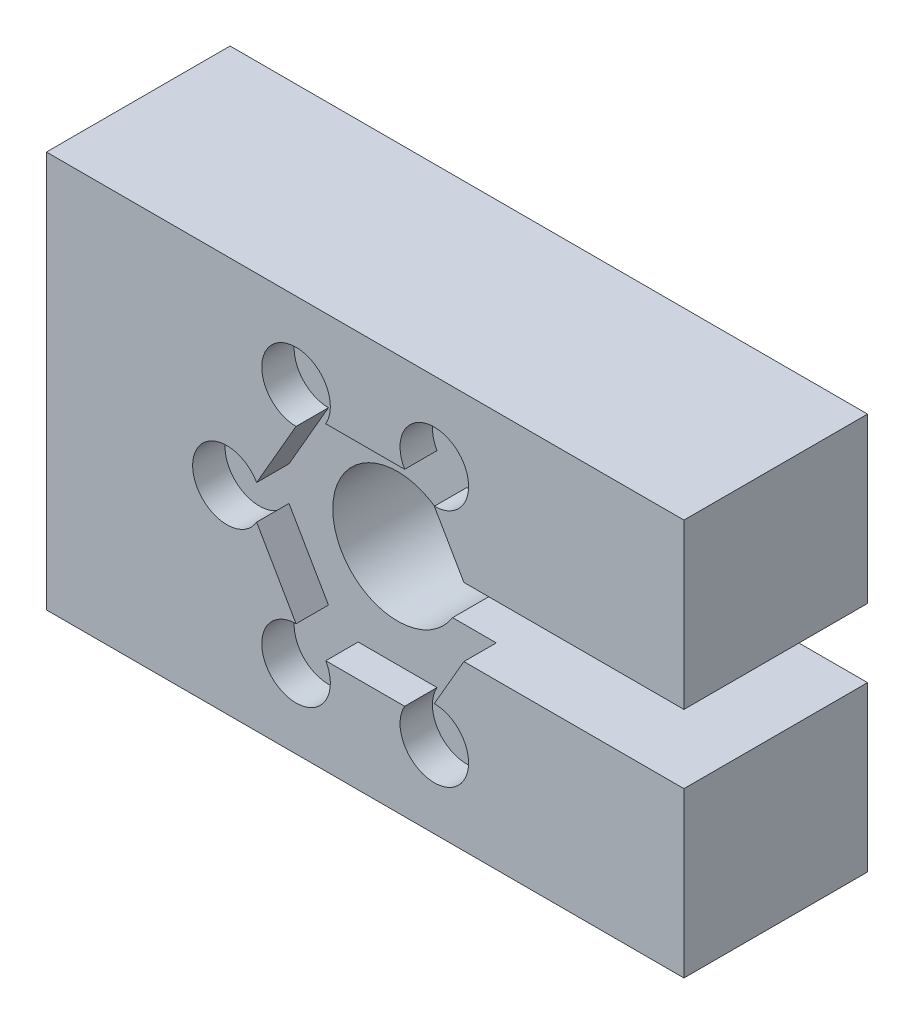
ISO-10303-21;
HEADER;
FILE_DESCRIPTION(('STEP AP214'),'2;1');
FILE_NAME('part.step','',(''),(''),'','','');
FILE_SCHEMA(('AUTOMOTIVE_DESIGN { 1 0 10303 214 1 1 1 1 }'));
ENDSEC;
DATA;
#1=APPLICATION_CONTEXT('core data for automotive mechanical design processes');
#2=APPLICATION_PROTOCOL_DEFINITION('international standard','automotive_design',2000,#1);
#3=PRODUCT_CONTEXT('',#1,'mechanical');
#4=PRODUCT('Part','Part','',(#3));
#5=PRODUCT_RELATED_PRODUCT_CATEGORY('part','',(#4));
#6=PRODUCT_DEFINITION_FORMATION('','',#4);
#7=PRODUCT_DEFINITION_CONTEXT('part definition',#1,'design');
#8=PRODUCT_DEFINITION('design','',#6,#7);
#9=PRODUCT_DEFINITION_SHAPE('','',#8);
#10=(LENGTH_UNIT() NAMED_UNIT(*) SI_UNIT(.MILLI.,.METRE.));
#11=(NAMED_UNIT(*) PLANE_ANGLE_UNIT() SI_UNIT($,.RADIAN.));
#12=(NAMED_UNIT(*) SI_UNIT($,.STERADIAN.) SOLID_ANGLE_UNIT());
#13=UNCERTAINTY_MEASURE_WITH_UNIT(LENGTH_MEASURE(1.E-05),#10,'distance_accuracy_value','');
#14=(GEOMETRIC_REPRESENTATION_CONTEXT(3) GLOBAL_UNCERTAINTY_ASSIGNED_CONTEXT((#13)) GLOBAL_UNIT_ASSIGNED_CONTEXT((#10,
#11,#12)) REPRESENTATION_CONTEXT('',''));
#15=CARTESIAN_POINT('',(0.,0.,0.));
#16=DIRECTION('',(0.,0.,1.));
#17=DIRECTION('',(1.,0.,0.));
#18=AXIS2_PLACEMENT_3D('',#15,#16,#17);
#19=CARTESIAN_POINT('',(14.755382296394,1.5875,1.5));
#20=DIRECTION('',(-1.,0.,0.));
#21=DIRECTION('',(0.,0.,1.));
#22=AXIS2_PLACEMENT_3D('',#19,#20,#21);
#23=PLANE('',#22);
#24=DIRECTION('',(0.,0.,-1.));
#25=VECTOR('',#24,1.);
#26=CARTESIAN_POINT('',(14.755382296394,1.5875,1.5));
#27=LINE('',#26,#25);
#28=CARTESIAN_POINT('',(14.755382296394,1.5875,1.5));
#29=VERTEX_POINT('',#28);
#30=CARTESIAN_POINT('',(14.755382296394,1.5875,-7.));
#31=VERTEX_POINT('',#30);
#32=EDGE_CURVE('E204',#29,#31,#27,.T.);
#33=ORIENTED_EDGE('',*,*,#32,.T.);
#34=DIRECTION('',(0.,-1.,0.));
#35=VECTOR('',#34,1.);
#36=CARTESIAN_POINT('',(14.755382296394,9.17903824382895,-7.));
#37=LINE('',#36,#35);
#38=CARTESIAN_POINT('',(14.755382296394,9.17903824382895,-7.));
#39=VERTEX_POINT('',#38);
#40=EDGE_CURVE('E259',#39,#31,#37,.T.);
#41=ORIENTED_EDGE('',*,*,#40,.F.);
#42=DIRECTION('',(0.,0.,-1.));
#43=VECTOR('',#42,1.);
#44=CARTESIAN_POINT('',(14.755382296394,9.17903824382895,1.5));
#45=LINE('',#44,#43);
#46=CARTESIAN_POINT('',(14.755382296394,9.17903824382895,1.5));
#47=VERTEX_POINT('',#46);
#48=EDGE_CURVE('E11',#47,#39,#45,.T.);
#49=ORIENTED_EDGE('',*,*,#48,.F.);
#50=DIRECTION('',(0.,1.,0.));
#51=VECTOR('',#50,1.);
#52=CARTESIAN_POINT('',(14.755382296394,1.5875,1.5));
#53=LINE('',#52,#51);
#54=EDGE_CURVE('E221',#29,#47,#53,.T.);
#55=ORIENTED_EDGE('',*,*,#54,.F.);
#56=EDGE_LOOP('',(#33,#41,#49,#55));
#57=FACE_BOUND('',#56,.T.);
#58=ADVANCED_FACE('F39',(#57),#23,.F.);
#59=CARTESIAN_POINT('',(-14.755382296394,9.17903824382895,1.5));
#60=DIRECTION('',(0.,-1.,0.));
#61=DIRECTION('',(0.,0.,-1.));
#62=AXIS2_PLACEMENT_3D('',#59,#60,#61);
#63=PLANE('',#62);
#64=ORIENTED_EDGE('',*,*,#48,.T.);
#65=DIRECTION('',(1.,0.,0.));
#66=VECTOR('',#65,1.);
#67=CARTESIAN_POINT('',(-14.755382296394,9.17903824382895,-7.));
#68=LINE('',#67,#66);
#69=CARTESIAN_POINT('',(-14.755382296394,9.17903824382895,-7.));
#70=VERTEX_POINT('',#69);
#71=EDGE_CURVE('E250',#70,#39,#68,.T.);
#72=ORIENTED_EDGE('',*,*,#71,.F.);
#73=DIRECTION('',(0.,0.,-1.));
#74=VECTOR('',#73,1.);
#75=CARTESIAN_POINT('',(-14.755382296394,9.17903824382895,1.5));
#76=LINE('',#75,#74);
#77=CARTESIAN_POINT('',(-14.755382296394,9.17903824382895,1.5));
#78=VERTEX_POINT('',#77);
#79=EDGE_CURVE('E46',#78,#70,#76,.T.);
#80=ORIENTED_EDGE('',*,*,#79,.F.);
#81=DIRECTION('',(-1.,0.,0.));
#82=VECTOR('',#81,1.);
#83=CARTESIAN_POINT('',(-14.755382296394,9.17903824382895,1.5));
#84=LINE('',#83,#82);
#85=EDGE_CURVE('E290',#47,#78,#84,.T.);
#86=ORIENTED_EDGE('',*,*,#85,.F.);
#87=EDGE_LOOP('',(#64,#72,#80,#86));
#88=FACE_BOUND('',#87,.T.);
#89=ADVANCED_FACE('F256',(#88),#63,.F.);
#90=CARTESIAN_POINT('',(-14.755382296394,-9.17903824382895,1.5));
#91=DIRECTION('',(1.,0.,0.));
#92=DIRECTION('',(0.,0.,-1.));
#93=AXIS2_PLACEMENT_3D('',#90,#91,#92);
#94=PLANE('',#93);
#95=ORIENTED_EDGE('',*,*,#79,.T.);
#96=DIRECTION('',(0.,1.,0.));
#97=VECTOR('',#96,1.);
#98=CARTESIAN_POINT('',(-14.755382296394,-9.17903824382895,-7.));
#99=LINE('',#98,#97);
#100=CARTESIAN_POINT('',(-14.755382296394,-9.17903824382895,-7.));
#101=VERTEX_POINT('',#100);
#102=EDGE_CURVE('E241',#101,#70,#99,.T.);
#103=ORIENTED_EDGE('',*,*,#102,.F.);
#104=DIRECTION('',(0.,0.,-1.));
#105=VECTOR('',#104,1.);
#106=CARTESIAN_POINT('',(-14.755382296394,-9.17903824382895,1.5));
#107=LINE('',#106,#105);
#108=CARTESIAN_POINT('',(-14.755382296394,-9.17903824382895,1.5));
#109=VERTEX_POINT('',#108);
#110=EDGE_CURVE('E233',#109,#101,#107,.T.);
#111=ORIENTED_EDGE('',*,*,#110,.F.);
#112=DIRECTION('',(0.,-1.,0.));
#113=VECTOR('',#112,1.);
#114=CARTESIAN_POINT('',(-14.755382296394,-9.17903824382895,1.5));
#115=LINE('',#114,#113);
#116=EDGE_CURVE('E242',#78,#109,#115,.T.);
#117=ORIENTED_EDGE('',*,*,#116,.F.);
#118=EDGE_LOOP('',(#95,#103,#111,#117));
#119=FACE_BOUND('',#118,.T.);
#120=ADVANCED_FACE('F239',(#119),#94,.F.);
#121=CARTESIAN_POINT('',(-14.755382296394,-9.17903824382895,1.5));
#122=DIRECTION('',(0.,1.,0.));
#123=DIRECTION('',(0.,0.,1.));
#124=AXIS2_PLACEMENT_3D('',#121,#122,#123);
#125=PLANE('',#124);
#126=ORIENTED_EDGE('',*,*,#110,.T.);
#127=DIRECTION('',(-1.,0.,0.));
#128=VECTOR('',#127,1.);
#129=CARTESIAN_POINT('',(14.755382296394,-9.17903824382895,-7.));
#130=LINE('',#129,#128);
#131=CARTESIAN_POINT('',(14.755382296394,-9.17903824382895,-7.));
#132=VERTEX_POINT('',#131);
#133=EDGE_CURVE('E253',#132,#101,#130,.T.);
#134=ORIENTED_EDGE('',*,*,#133,.F.);
#135=DIRECTION('',(0.,0.,-1.));
#136=VECTOR('',#135,1.);
#137=CARTESIAN_POINT('',(14.755382296394,-9.17903824382895,1.5));
#138=LINE('',#137,#136);
#139=CARTESIAN_POINT('',(14.755382296394,-9.17903824382895,1.5));
#140=VERTEX_POINT('',#139);
#141=EDGE_CURVE('E231',#140,#132,#138,.T.);
#142=ORIENTED_EDGE('',*,*,#141,.F.);
#143=DIRECTION('',(1.,0.,0.));
#144=VECTOR('',#143,1.);
#145=CARTESIAN_POINT('',(-14.755382296394,-9.17903824382895,1.5));
#146=LINE('',#145,#144);
#147=EDGE_CURVE('E293',#109,#140,#146,.T.);
#148=ORIENTED_EDGE('',*,*,#147,.F.);
#149=EDGE_LOOP('',(#126,#134,#142,#148));
#150=FACE_BOUND('',#149,.T.);
#151=ADVANCED_FACE('F388',(#150),#125,.F.);
#152=CARTESIAN_POINT('',(14.755382296394,-9.17903824382895,1.5));
#153=DIRECTION('',(-1.,0.,0.));
#154=DIRECTION('',(0.,0.,1.));
#155=AXIS2_PLACEMENT_3D('',#152,#153,#154);
#156=PLANE('',#155);
#157=ORIENTED_EDGE('',*,*,#141,.T.);
#158=DIRECTION('',(0.,-1.,0.));
#159=VECTOR('',#158,1.);
#160=CARTESIAN_POINT('',(14.755382296394,-1.5875,-7.));
#161=LINE('',#160,#159);
#162=CARTESIAN_POINT('',(14.755382296394,-1.5875,-7.));
#163=VERTEX_POINT('',#162);
#164=EDGE_CURVE('E277',#163,#132,#161,.T.);
#165=ORIENTED_EDGE('',*,*,#164,.F.);
#166=DIRECTION('',(0.,0.,-1.));
#167=VECTOR('',#166,1.);
#168=CARTESIAN_POINT('',(14.755382296394,-1.5875,1.5));
#169=LINE('',#168,#167);
#170=CARTESIAN_POINT('',(14.755382296394,-1.5875,1.5));
#171=VERTEX_POINT('',#170);
#172=EDGE_CURVE('E229',#171,#163,#169,.T.);
#173=ORIENTED_EDGE('',*,*,#172,.F.);
#174=DIRECTION('',(0.,1.,0.));
#175=VECTOR('',#174,1.);
#176=CARTESIAN_POINT('',(14.755382296394,-9.17903824382895,1.5));
#177=LINE('',#176,#175);
#178=EDGE_CURVE('E295',#140,#171,#177,.T.);
#179=ORIENTED_EDGE('',*,*,#178,.F.);
#180=EDGE_LOOP('',(#157,#165,#173,#179));
#181=FACE_BOUND('',#180,.T.);
#182=ADVANCED_FACE('F383',(#181),#156,.F.);
#183=CARTESIAN_POINT('',(14.755382296394,-1.5875,1.5));
#184=DIRECTION('',(0.,-1.,0.));
#185=DIRECTION('',(1.,0.,0.));
#186=AXIS2_PLACEMENT_3D('',#183,#184,#185);
#187=PLANE('',#186);
#188=DIRECTION('',(0.,0.,-1.));
#189=VECTOR('',#188,1.);
#190=CARTESIAN_POINT('',(4.56828400496291,-1.5875,1.5));
#191=LINE('',#190,#189);
#192=CARTESIAN_POINT('',(4.56828400496291,-1.5875,1.5));
#193=VERTEX_POINT('',#192);
#194=CARTESIAN_POINT('',(4.56828400496291,-1.5875,0.));
#195=VERTEX_POINT('',#194);
#196=EDGE_CURVE('E226',#193,#195,#191,.T.);
#197=ORIENTED_EDGE('',*,*,#196,.F.);
#198=DIRECTION('',(-1.,0.,0.));
#199=VECTOR('',#198,1.);
#200=CARTESIAN_POINT('',(14.755382296394,-1.5875,1.5));
#201=LINE('',#200,#199);
#202=EDGE_CURVE('E297',#171,#193,#201,.T.);
#203=ORIENTED_EDGE('',*,*,#202,.F.);
#204=ORIENTED_EDGE('',*,*,#172,.T.);
#205=DIRECTION('',(1.,0.,0.));
#206=VECTOR('',#205,1.);
#207=CARTESIAN_POINT('',(4.56828400496291,-1.5875,-7.));
#208=LINE('',#207,#206);
#209=CARTESIAN_POINT('',(2.54555372168807,-1.5875,-7.));
#210=VERTEX_POINT('',#209);
#211=EDGE_CURVE('E274',#210,#163,#208,.T.);
#212=ORIENTED_EDGE('',*,*,#211,.F.);
#213=DIRECTION('',(0.,0.,1.));
#214=VECTOR('',#213,1.);
#215=CARTESIAN_POINT('',(2.54555372168807,-1.5875,-7.));
#216=LINE('',#215,#214);
#217=CARTESIAN_POINT('',(2.54555372168807,-1.5875,0.));
#218=VERTEX_POINT('',#217);
#219=EDGE_CURVE('E254',#210,#218,#216,.T.);
#220=ORIENTED_EDGE('',*,*,#219,.T.);
#221=DIRECTION('',(1.,0.,0.));
#222=VECTOR('',#221,1.);
#223=CARTESIAN_POINT('',(4.56828400496291,-1.5875,0.));
#224=LINE('',#223,#222);
#225=EDGE_CURVE('E260',#218,#195,#224,.T.);
#226=ORIENTED_EDGE('',*,*,#225,.T.);
#227=EDGE_LOOP('',(#197,#203,#204,#212,#220,#226));
#228=FACE_BOUND('',#227,.T.);
#229=ADVANCED_FACE('F360',(#228),#187,.F.);
#230=CARTESIAN_POINT('',(2.74241377865072,-4.75,1.5));
#231=DIRECTION('',(0.866025403784439,-0.499999999999999,0.));
#232=DIRECTION('',(0.499999999999999,0.866025403784439,0.));
#233=AXIS2_PLACEMENT_3D('',#230,#231,#232);
#234=PLANE('',#233);
#235=DIRECTION('',(-0.499999999999999,-0.866025403784439,0.));
#236=VECTOR('',#235,1.);
#237=CARTESIAN_POINT('',(2.74241377865072,-4.75,0.));
#238=LINE('',#237,#236);
#239=CARTESIAN_POINT('',(3.20068555481998,-3.95625000000002,0.));
#240=VERTEX_POINT('',#239);
#241=EDGE_CURVE('E205',#195,#240,#238,.T.);
#242=ORIENTED_EDGE('',*,*,#241,.T.);
#243=DIRECTION('',(0.,0.,1.));
#244=VECTOR('',#243,1.);
#245=CARTESIAN_POINT('',(3.20068555481998,-3.95625000000002,-4.49012806053458));
#246=LINE('',#245,#244);
#247=CARTESIAN_POINT('',(3.20068555481998,-3.95625000000002,1.5));
#248=VERTEX_POINT('',#247);
#249=EDGE_CURVE('E329',#240,#248,#246,.T.);
#250=ORIENTED_EDGE('',*,*,#249,.T.);
#251=DIRECTION('',(-0.499999999999999,-0.866025403784439,0.));
#252=VECTOR('',#251,1.);
#253=CARTESIAN_POINT('',(2.74241377865072,-4.75,1.5));
#254=LINE('',#253,#252);
#255=EDGE_CURVE('E299',#193,#248,#254,.T.);
#256=ORIENTED_EDGE('',*,*,#255,.F.);
#257=ORIENTED_EDGE('',*,*,#196,.T.);
#258=EDGE_LOOP('',(#242,#250,#256,#257));
#259=FACE_BOUND('',#258,.T.);
#260=ADVANCED_FACE('F355',(#259),#234,.F.);
#261=CARTESIAN_POINT('',(-2.74241377865072,-4.75,1.5));
#262=DIRECTION('',(0.,-1.,0.));
#263=DIRECTION('',(1.,0.,0.));
#264=AXIS2_PLACEMENT_3D('',#261,#262,#263);
#265=PLANE('',#264);
#266=DIRECTION('',(-1.,0.,0.));
#267=VECTOR('',#266,1.);
#268=CARTESIAN_POINT('',(-2.74241377865072,-4.75,0.));
#269=LINE('',#268,#267);
#270=CARTESIAN_POINT('',(1.82587022631217,-4.75,0.));
#271=VERTEX_POINT('',#270);
#272=CARTESIAN_POINT('',(-1.82587022631222,-4.75,0.));
#273=VERTEX_POINT('',#272);
#274=EDGE_CURVE('E208',#271,#273,#269,.T.);
#275=ORIENTED_EDGE('',*,*,#274,.T.);
#276=DIRECTION('',(0.,0.,1.));
#277=VECTOR('',#276,1.);
#278=CARTESIAN_POINT('',(-1.82587022631222,-4.75,-4.49012806053458));
#279=LINE('',#278,#277);
#280=CARTESIAN_POINT('',(-1.82587022631222,-4.75,1.5));
#281=VERTEX_POINT('',#280);
#282=EDGE_CURVE('E323',#273,#281,#279,.T.);
#283=ORIENTED_EDGE('',*,*,#282,.T.);
#284=DIRECTION('',(-1.,0.,0.));
#285=VECTOR('',#284,1.);
#286=CARTESIAN_POINT('',(-2.74241377865072,-4.75,1.5));
#287=LINE('',#286,#285);
#288=CARTESIAN_POINT('',(1.82587022631217,-4.75,1.5));
#289=VERTEX_POINT('',#288);
#290=EDGE_CURVE('E302',#289,#281,#287,.T.);
#291=ORIENTED_EDGE('',*,*,#290,.F.);
#292=DIRECTION('',(0.,0.,1.));
#293=VECTOR('',#292,1.);
#294=CARTESIAN_POINT('',(1.82587022631217,-4.75,-4.49012806053458));
#295=LINE('',#294,#293);
#296=EDGE_CURVE('E189',#289,#271,#295,.F.);
#297=ORIENTED_EDGE('',*,*,#296,.T.);
#298=EDGE_LOOP('',(#275,#283,#291,#297));
#299=FACE_BOUND('',#298,.T.);
#300=ADVANCED_FACE('F392',(#299),#265,.F.);
#301=CARTESIAN_POINT('',(-5.48482755730144,0.,1.5));
#302=DIRECTION('',(-0.866025403784438,-0.5,0.));
#303=DIRECTION('',(0.5,-0.866025403784439,0.));
#304=AXIS2_PLACEMENT_3D('',#301,#302,#303);
#305=PLANE('',#304);
#306=DIRECTION('',(-0.5,0.866025403784438,0.));
#307=VECTOR('',#306,1.);
#308=CARTESIAN_POINT('',(-5.48482755730144,0.,0.));
#309=LINE('',#308,#307);
#310=CARTESIAN_POINT('',(-3.20068555482,-3.95624999999998,0.));
#311=VERTEX_POINT('',#310);
#312=CARTESIAN_POINT('',(-5.0265557811322,-0.793749999999971,0.));
#313=VERTEX_POINT('',#312);
#314=EDGE_CURVE('E212',#311,#313,#309,.T.);
#315=ORIENTED_EDGE('',*,*,#314,.T.);
#316=DIRECTION('',(0.,0.,1.));
#317=VECTOR('',#316,1.);
#318=CARTESIAN_POINT('',(-5.0265557811322,-0.79374999999997,-4.49012806053458));
#319=LINE('',#318,#317);
#320=CARTESIAN_POINT('',(-5.0265557811322,-0.793749999999971,1.5));
#321=VERTEX_POINT('',#320);
#322=EDGE_CURVE('E317',#313,#321,#319,.T.);
#323=ORIENTED_EDGE('',*,*,#322,.T.);
#324=DIRECTION('',(-0.5,0.866025403784438,0.));
#325=VECTOR('',#324,1.);
#326=CARTESIAN_POINT('',(-5.48482755730144,0.,1.5));
#327=LINE('',#326,#325);
#328=CARTESIAN_POINT('',(-3.20068555482,-3.95624999999998,1.5));
#329=VERTEX_POINT('',#328);
#330=EDGE_CURVE('E199',#329,#321,#327,.T.);
#331=ORIENTED_EDGE('',*,*,#330,.F.);
#332=DIRECTION('',(0.,0.,1.));
#333=VECTOR('',#332,1.);
#334=CARTESIAN_POINT('',(-3.20068555482,-3.95624999999998,-4.49012806053458));
#335=LINE('',#334,#333);
#336=EDGE_CURVE('E315',#329,#311,#335,.F.);
#337=ORIENTED_EDGE('',*,*,#336,.T.);
#338=EDGE_LOOP('',(#315,#323,#331,#337));
#339=FACE_BOUND('',#338,.T.);
#340=ADVANCED_FACE('F314',(#339),#305,.F.);
#341=CARTESIAN_POINT('',(-2.74241377865072,4.75,1.5));
#342=DIRECTION('',(-0.866025403784439,0.5,0.));
#343=DIRECTION('',(-0.5,-0.866025403784439,0.));
#344=AXIS2_PLACEMENT_3D('',#341,#342,#343);
#345=PLANE('',#344);
#346=DIRECTION('',(0.5,0.866025403784439,0.));
#347=VECTOR('',#346,1.);
#348=CARTESIAN_POINT('',(-2.74241377865072,4.75,0.));
#349=LINE('',#348,#347);
#350=CARTESIAN_POINT('',(-5.02655578113216,0.793750000000027,0.));
#351=VERTEX_POINT('',#350);
#352=CARTESIAN_POINT('',(-3.20068555481997,3.95625000000004,0.));
#353=VERTEX_POINT('',#352);
#354=EDGE_CURVE('E215',#351,#353,#349,.T.);
#355=ORIENTED_EDGE('',*,*,#354,.T.);
#356=DIRECTION('',(0.,0.,1.));
#357=VECTOR('',#356,1.);
#358=CARTESIAN_POINT('',(-3.20068555481997,3.95625000000004,-4.49012806053458));
#359=LINE('',#358,#357);
#360=CARTESIAN_POINT('',(-3.20068555481997,3.95625000000004,1.5));
#361=VERTEX_POINT('',#360);
#362=EDGE_CURVE('E268',#353,#361,#359,.T.);
#363=ORIENTED_EDGE('',*,*,#362,.T.);
#364=DIRECTION('',(0.5,0.866025403784439,0.));
#365=VECTOR('',#364,1.);
#366=CARTESIAN_POINT('',(-2.74241377865072,4.75,1.5));
#367=LINE('',#366,#365);
#368=CARTESIAN_POINT('',(-5.02655578113216,0.793750000000027,1.5));
#369=VERTEX_POINT('',#368);
#370=EDGE_CURVE('E195',#369,#361,#367,.T.);
#371=ORIENTED_EDGE('',*,*,#370,.F.);
#372=DIRECTION('',(0.,0.,1.));
#373=VECTOR('',#372,1.);
#374=CARTESIAN_POINT('',(-5.02655578113216,0.793750000000027,-4.49012806053458));
#375=LINE('',#374,#373);
#376=EDGE_CURVE('E320',#369,#351,#375,.F.);
#377=ORIENTED_EDGE('',*,*,#376,.T.);
#378=EDGE_LOOP('',(#355,#363,#371,#377));
#379=FACE_BOUND('',#378,.T.);
#380=ADVANCED_FACE('F398',(#379),#345,.F.);
#381=CARTESIAN_POINT('',(2.74241377865072,4.75,1.5));
#382=DIRECTION('',(0.,1.,0.));
#383=DIRECTION('',(0.,0.,1.));
#384=AXIS2_PLACEMENT_3D('',#381,#382,#383);
#385=PLANE('',#384);
#386=DIRECTION('',(1.,0.,0.));
#387=VECTOR('',#386,1.);
#388=CARTESIAN_POINT('',(2.74241377865072,4.75,1.5));
#389=LINE('',#388,#387);
#390=CARTESIAN_POINT('',(-1.82587022631215,4.75,1.5));
#391=VERTEX_POINT('',#390);
#392=CARTESIAN_POINT('',(1.82587022631219,4.75,1.5));
#393=VERTEX_POINT('',#392);
#394=EDGE_CURVE('E186',#391,#393,#389,.T.);
#395=ORIENTED_EDGE('',*,*,#394,.F.);
#396=DIRECTION('',(0.,0.,1.));
#397=VECTOR('',#396,1.);
#398=CARTESIAN_POINT('',(-1.82587022631215,4.75,-4.49012806053458));
#399=LINE('',#398,#397);
#400=CARTESIAN_POINT('',(-1.82587022631215,4.75,0.));
#401=VERTEX_POINT('',#400);
#402=EDGE_CURVE('E61',#391,#401,#399,.F.);
#403=ORIENTED_EDGE('',*,*,#402,.T.);
#404=DIRECTION('',(1.,0.,0.));
#405=VECTOR('',#404,1.);
#406=CARTESIAN_POINT('',(2.74241377865072,4.75,0.));
#407=LINE('',#406,#405);
#408=CARTESIAN_POINT('',(1.82587022631219,4.75,0.));
#409=VERTEX_POINT('',#408);
#410=EDGE_CURVE('E188',#401,#409,#407,.T.);
#411=ORIENTED_EDGE('',*,*,#410,.T.);
#412=DIRECTION('',(0.,0.,1.));
#413=VECTOR('',#412,1.);
#414=CARTESIAN_POINT('',(1.82587022631219,4.75,-4.49012806053458));
#415=LINE('',#414,#413);
#416=EDGE_CURVE('E174',#409,#393,#415,.T.);
#417=ORIENTED_EDGE('',*,*,#416,.T.);
#418=EDGE_LOOP('',(#395,#403,#411,#417));
#419=FACE_BOUND('',#418,.T.);
#420=ADVANCED_FACE('F185',(#419),#385,.F.);
#421=CARTESIAN_POINT('',(4.56828400496292,1.5875,1.5));
#422=DIRECTION('',(0.866025403784438,0.500000000000001,0.));
#423=DIRECTION('',(-0.500000000000001,0.866025403784438,0.));
#424=AXIS2_PLACEMENT_3D('',#421,#422,#423);
#425=PLANE('',#424);
#426=DIRECTION('',(0.500000000000001,-0.866025403784438,0.));
#427=VECTOR('',#426,1.);
#428=CARTESIAN_POINT('',(4.56828400496292,1.5875,1.5));
#429=LINE('',#428,#427);
#430=CARTESIAN_POINT('',(3.20068555481999,3.95625,1.5));
#431=VERTEX_POINT('',#430);
#432=CARTESIAN_POINT('',(4.56828400496292,1.5875,1.5));
#433=VERTEX_POINT('',#432);
#434=EDGE_CURVE('E194',#431,#433,#429,.T.);
#435=ORIENTED_EDGE('',*,*,#434,.F.);
#436=DIRECTION('',(0.,0.,1.));
#437=VECTOR('',#436,1.);
#438=CARTESIAN_POINT('',(3.20068555481999,3.95625,-4.49012806053458));
#439=LINE('',#438,#437);
#440=CARTESIAN_POINT('',(3.20068555481999,3.95625,0.));
#441=VERTEX_POINT('',#440);
#442=EDGE_CURVE('E53',#431,#441,#439,.F.);
#443=ORIENTED_EDGE('',*,*,#442,.T.);
#444=DIRECTION('',(0.500000000000001,-0.866025403784438,0.));
#445=VECTOR('',#444,1.);
#446=CARTESIAN_POINT('',(4.56828400496292,1.5875,0.));
#447=LINE('',#446,#445);
#448=CARTESIAN_POINT('',(4.56828400496292,1.5875,0.));
#449=VERTEX_POINT('',#448);
#450=EDGE_CURVE('E219',#441,#449,#447,.T.);
#451=ORIENTED_EDGE('',*,*,#450,.T.);
#452=DIRECTION('',(0.,0.,-1.));
#453=VECTOR('',#452,1.);
#454=CARTESIAN_POINT('',(4.56828400496292,1.5875,1.5));
#455=LINE('',#454,#453);
#456=EDGE_CURVE('E223',#433,#449,#455,.T.);
#457=ORIENTED_EDGE('',*,*,#456,.F.);
#458=EDGE_LOOP('',(#435,#443,#451,#457));
#459=FACE_BOUND('',#458,.T.);
#460=ADVANCED_FACE('F377',(#459),#425,.F.);
#461=CARTESIAN_POINT('',(14.755382296394,1.5875,1.5));
#462=DIRECTION('',(0.,1.,0.));
#463=DIRECTION('',(-1.,0.,0.));
#464=AXIS2_PLACEMENT_3D('',#461,#462,#463);
#465=PLANE('',#464);
#466=ORIENTED_EDGE('',*,*,#32,.F.);
#467=DIRECTION('',(1.,0.,0.));
#468=VECTOR('',#467,1.);
#469=CARTESIAN_POINT('',(14.755382296394,1.5875,1.5));
#470=LINE('',#469,#468);
#471=EDGE_CURVE('E197',#433,#29,#470,.T.);
#472=ORIENTED_EDGE('',*,*,#471,.F.);
#473=ORIENTED_EDGE('',*,*,#456,.T.);
#474=DIRECTION('',(-1.,0.,0.));
#475=VECTOR('',#474,1.);
#476=CARTESIAN_POINT('',(4.56828400496292,1.5875,0.));
#477=LINE('',#476,#475);
#478=CARTESIAN_POINT('',(2.54555372168807,1.5875,0.));
#479=VERTEX_POINT('',#478);
#480=EDGE_CURVE('E280',#449,#479,#477,.T.);
#481=ORIENTED_EDGE('',*,*,#480,.T.);
#482=DIRECTION('',(0.,0.,1.));
#483=VECTOR('',#482,1.);
#484=CARTESIAN_POINT('',(2.54555372168807,1.5875,-7.));
#485=LINE('',#484,#483);
#486=CARTESIAN_POINT('',(2.54555372168807,1.5875,-7.));
#487=VERTEX_POINT('',#486);
#488=EDGE_CURVE('E209',#487,#479,#485,.T.);
#489=ORIENTED_EDGE('',*,*,#488,.F.);
#490=DIRECTION('',(-1.,0.,0.));
#491=VECTOR('',#490,1.);
#492=CARTESIAN_POINT('',(14.755382296394,1.5875,-7.));
#493=LINE('',#492,#491);
#494=EDGE_CURVE('E262',#31,#487,#493,.T.);
#495=ORIENTED_EDGE('',*,*,#494,.F.);
#496=EDGE_LOOP('',(#466,#472,#473,#481,#489,#495));
#497=FACE_BOUND('',#496,.T.);
#498=ADVANCED_FACE('F372',(#497),#465,.F.);
#499=CARTESIAN_POINT('',(0.,0.,1.5));
#500=DIRECTION('',(0.,0.,-1.));
#501=DIRECTION('',(-1.,0.,0.));
#502=AXIS2_PLACEMENT_3D('',#499,#500,#501);
#503=PLANE('',#502);
#504=ORIENTED_EDGE('',*,*,#370,.T.);
#505=CARTESIAN_POINT('',(-3.20068555481992,5.54375000000004,1.5));
#506=DIRECTION('',(0.,0.,1.));
#507=DIRECTION('',(1.,0.,0.));
#508=AXIS2_PLACEMENT_3D('',#505,#506,#507);
#509=CIRCLE('',#508,1.5875);
#510=EDGE_CURVE('E193',#391,#361,#509,.T.);
#511=ORIENTED_EDGE('',*,*,#510,.F.);
#512=ORIENTED_EDGE('',*,*,#394,.T.);
#513=CARTESIAN_POINT('',(3.20068555481999,5.54375,1.5));
#514=DIRECTION('',(0.,0.,1.));
#515=DIRECTION('',(1.,0.,0.));
#516=AXIS2_PLACEMENT_3D('',#513,#514,#515);
#517=CIRCLE('',#516,1.5875);
#518=EDGE_CURVE('E171',#431,#393,#517,.T.);
#519=ORIENTED_EDGE('',*,*,#518,.F.);
#520=ORIENTED_EDGE('',*,*,#434,.T.);
#521=ORIENTED_EDGE('',*,*,#471,.T.);
#522=ORIENTED_EDGE('',*,*,#54,.T.);
#523=ORIENTED_EDGE('',*,*,#85,.T.);
#524=ORIENTED_EDGE('',*,*,#116,.T.);
#525=ORIENTED_EDGE('',*,*,#147,.T.);
#526=ORIENTED_EDGE('',*,*,#178,.T.);
#527=ORIENTED_EDGE('',*,*,#202,.T.);
#528=ORIENTED_EDGE('',*,*,#255,.T.);
#529=CARTESIAN_POINT('',(3.20068555481996,-5.54375000000002,1.5));
#530=DIRECTION('',(0.,0.,1.));
#531=DIRECTION('',(1.,0.,0.));
#532=AXIS2_PLACEMENT_3D('',#529,#530,#531);
#533=CIRCLE('',#532,1.5875);
#534=EDGE_CURVE('E180',#289,#248,#533,.T.);
#535=ORIENTED_EDGE('',*,*,#534,.F.);
#536=ORIENTED_EDGE('',*,*,#290,.T.);
#537=CARTESIAN_POINT('',(-3.20068555482003,-5.54374999999998,1.5));
#538=DIRECTION('',(0.,0.,1.));
#539=DIRECTION('',(1.,0.,0.));
#540=AXIS2_PLACEMENT_3D('',#537,#538,#539);
#541=CIRCLE('',#540,1.5875);
#542=EDGE_CURVE('E310',#329,#281,#541,.T.);
#543=ORIENTED_EDGE('',*,*,#542,.F.);
#544=ORIENTED_EDGE('',*,*,#330,.T.);
#545=CARTESIAN_POINT('',(-6.40137110963998,0.,1.5));
#546=DIRECTION('',(0.,0.,1.));
#547=DIRECTION('',(1.,0.,0.));
#548=AXIS2_PLACEMENT_3D('',#545,#546,#547);
#549=CIRCLE('',#548,1.5875);
#550=EDGE_CURVE('E308',#369,#321,#549,.T.);
#551=ORIENTED_EDGE('',*,*,#550,.F.);
#552=EDGE_LOOP('',(#504,#511,#512,#519,#520,#521,#522,#523,#524,#525,#526,#527,#528,#535,#536,
#543,#544,#551));
#553=FACE_BOUND('',#552,.T.);
#554=ADVANCED_FACE('F192',(#553),#503,.F.);
#555=CARTESIAN_POINT('',(0.,0.,-7.));
#556=DIRECTION('',(0.,0.,1.));
#557=DIRECTION('',(1.,0.,0.));
#558=AXIS2_PLACEMENT_3D('',#555,#556,#557);
#559=CYLINDRICAL_SURFACE('',#558,3.);
#560=CARTESIAN_POINT('',(0.,0.,0.));
#561=DIRECTION('',(0.,0.,1.));
#562=DIRECTION('',(-1.,0.,0.));
#563=AXIS2_PLACEMENT_3D('',#560,#561,#562);
#564=CIRCLE('',#563,3.);
#565=EDGE_CURVE('E265',#479,#218,#564,.T.);
#566=ORIENTED_EDGE('',*,*,#565,.T.);
#567=ORIENTED_EDGE('',*,*,#219,.F.);
#568=CARTESIAN_POINT('',(0.,0.,-7.));
#569=DIRECTION('',(0.,0.,1.));
#570=DIRECTION('',(-1.,0.,0.));
#571=AXIS2_PLACEMENT_3D('',#568,#569,#570);
#572=CIRCLE('',#571,3.);
#573=EDGE_CURVE('E272',#487,#210,#572,.T.);
#574=ORIENTED_EDGE('',*,*,#573,.F.);
#575=ORIENTED_EDGE('',*,*,#488,.T.);
#576=EDGE_LOOP('',(#566,#567,#574,#575));
#577=FACE_BOUND('',#576,.T.);
#578=ADVANCED_FACE('F366',(#577),#559,.F.);
#579=CARTESIAN_POINT('',(0.,0.,-7.));
#580=DIRECTION('',(0.,0.,-1.));
#581=DIRECTION('',(-1.,0.,0.));
#582=AXIS2_PLACEMENT_3D('',#579,#580,#581);
#583=PLANE('',#582);
#584=ORIENTED_EDGE('',*,*,#71,.T.);
#585=ORIENTED_EDGE('',*,*,#40,.T.);
#586=ORIENTED_EDGE('',*,*,#494,.T.);
#587=ORIENTED_EDGE('',*,*,#573,.T.);
#588=ORIENTED_EDGE('',*,*,#211,.T.);
#589=ORIENTED_EDGE('',*,*,#164,.T.);
#590=ORIENTED_EDGE('',*,*,#133,.T.);
#591=ORIENTED_EDGE('',*,*,#102,.T.);
#592=EDGE_LOOP('',(#584,#585,#586,#587,#588,#589,#590,#591));
#593=FACE_BOUND('',#592,.T.);
#594=ADVANCED_FACE('F248',(#593),#583,.T.);
#595=CARTESIAN_POINT('',(0.,0.,0.));
#596=DIRECTION('',(0.,0.,-1.));
#597=DIRECTION('',(-1.,0.,0.));
#598=AXIS2_PLACEMENT_3D('',#595,#596,#597);
#599=PLANE('',#598);
#600=ORIENTED_EDGE('',*,*,#410,.F.);
#601=CARTESIAN_POINT('',(-3.20068555481992,5.54375000000004,0.));
#602=DIRECTION('',(0.,0.,-1.));
#603=DIRECTION('',(-1.,0.,0.));
#604=AXIS2_PLACEMENT_3D('',#601,#602,#603);
#605=CIRCLE('',#604,1.5875);
#606=EDGE_CURVE('E338',#401,#353,#605,.F.);
#607=ORIENTED_EDGE('',*,*,#606,.T.);
#608=ORIENTED_EDGE('',*,*,#354,.F.);
#609=CARTESIAN_POINT('',(-6.40137110963998,0.,0.));
#610=DIRECTION('',(0.,0.,-1.));
#611=DIRECTION('',(-1.,0.,0.));
#612=AXIS2_PLACEMENT_3D('',#609,#610,#611);
#613=CIRCLE('',#612,1.5875);
#614=EDGE_CURVE('E337',#351,#313,#613,.F.);
#615=ORIENTED_EDGE('',*,*,#614,.T.);
#616=ORIENTED_EDGE('',*,*,#314,.F.);
#617=CARTESIAN_POINT('',(-3.20068555482003,-5.54374999999998,0.));
#618=DIRECTION('',(0.,0.,-1.));
#619=DIRECTION('',(-1.,0.,0.));
#620=AXIS2_PLACEMENT_3D('',#617,#618,#619);
#621=CIRCLE('',#620,1.5875);
#622=EDGE_CURVE('E342',#311,#273,#621,.F.);
#623=ORIENTED_EDGE('',*,*,#622,.T.);
#624=ORIENTED_EDGE('',*,*,#274,.F.);
#625=CARTESIAN_POINT('',(3.20068555481996,-5.54375000000002,0.));
#626=DIRECTION('',(0.,0.,-1.));
#627=DIRECTION('',(-1.,0.,0.));
#628=AXIS2_PLACEMENT_3D('',#625,#626,#627);
#629=CIRCLE('',#628,1.5875);
#630=EDGE_CURVE('E345',#271,#240,#629,.F.);
#631=ORIENTED_EDGE('',*,*,#630,.T.);
#632=ORIENTED_EDGE('',*,*,#241,.F.);
#633=ORIENTED_EDGE('',*,*,#225,.F.);
#634=ORIENTED_EDGE('',*,*,#565,.F.);
#635=ORIENTED_EDGE('',*,*,#480,.F.);
#636=ORIENTED_EDGE('',*,*,#450,.F.);
#637=CARTESIAN_POINT('',(3.20068555481999,5.54375,0.));
#638=DIRECTION('',(0.,0.,-1.));
#639=DIRECTION('',(-1.,0.,0.));
#640=AXIS2_PLACEMENT_3D('',#637,#638,#639);
#641=CIRCLE('',#640,1.5875);
#642=EDGE_CURVE('E179',#441,#409,#641,.F.);
#643=ORIENTED_EDGE('',*,*,#642,.T.);
#644=EDGE_LOOP('',(#600,#607,#608,#615,#616,#623,#624,#631,#632,#633,#634,#635,#636,#643));
#645=FACE_BOUND('',#644,.T.);
#646=ADVANCED_FACE('F352',(#645),#599,.F.);
#647=CARTESIAN_POINT('',(3.20068555481999,5.54375,-4.49012806053458));
#648=DIRECTION('',(0.,0.,1.));
#649=DIRECTION('',(1.,0.,0.));
#650=AXIS2_PLACEMENT_3D('',#647,#648,#649);
#651=CYLINDRICAL_SURFACE('',#650,1.5875);
#652=ORIENTED_EDGE('',*,*,#642,.F.);
#653=ORIENTED_EDGE('',*,*,#442,.F.);
#654=ORIENTED_EDGE('',*,*,#518,.T.);
#655=ORIENTED_EDGE('',*,*,#416,.F.);
#656=EDGE_LOOP('',(#652,#653,#654,#655));
#657=FACE_BOUND('',#656,.T.);
#658=ADVANCED_FACE('F173',(#657),#651,.F.);
#659=CARTESIAN_POINT('',(3.20068555481996,-5.54375000000002,-4.49012806053458));
#660=DIRECTION('',(0.,0.,1.));
#661=DIRECTION('',(1.,0.,0.));
#662=AXIS2_PLACEMENT_3D('',#659,#660,#661);
#663=CYLINDRICAL_SURFACE('',#662,1.5875);
#664=ORIENTED_EDGE('',*,*,#630,.F.);
#665=ORIENTED_EDGE('',*,*,#296,.F.);
#666=ORIENTED_EDGE('',*,*,#534,.T.);
#667=ORIENTED_EDGE('',*,*,#249,.F.);
#668=EDGE_LOOP('',(#664,#665,#666,#667));
#669=FACE_BOUND('',#668,.T.);
#670=ADVANCED_FACE('F445',(#669),#663,.F.);
#671=CARTESIAN_POINT('',(-3.20068555482003,-5.54374999999998,-4.49012806053458));
#672=DIRECTION('',(0.,0.,1.));
#673=DIRECTION('',(1.,0.,0.));
#674=AXIS2_PLACEMENT_3D('',#671,#672,#673);
#675=CYLINDRICAL_SURFACE('',#674,1.5875);
#676=ORIENTED_EDGE('',*,*,#622,.F.);
#677=ORIENTED_EDGE('',*,*,#336,.F.);
#678=ORIENTED_EDGE('',*,*,#542,.T.);
#679=ORIENTED_EDGE('',*,*,#282,.F.);
#680=EDGE_LOOP('',(#676,#677,#678,#679));
#681=FACE_BOUND('',#680,.T.);
#682=ADVANCED_FACE('F394',(#681),#675,.F.);
#683=CARTESIAN_POINT('',(-6.40137110963998,0.,-4.49012806053458));
#684=DIRECTION('',(0.,0.,1.));
#685=DIRECTION('',(1.,0.,0.));
#686=AXIS2_PLACEMENT_3D('',#683,#684,#685);
#687=CYLINDRICAL_SURFACE('',#686,1.5875);
#688=ORIENTED_EDGE('',*,*,#614,.F.);
#689=ORIENTED_EDGE('',*,*,#376,.F.);
#690=ORIENTED_EDGE('',*,*,#550,.T.);
#691=ORIENTED_EDGE('',*,*,#322,.F.);
#692=EDGE_LOOP('',(#688,#689,#690,#691));
#693=FACE_BOUND('',#692,.T.);
#694=ADVANCED_FACE('F396',(#693),#687,.F.);
#695=CARTESIAN_POINT('',(-3.20068555481992,5.54375000000004,-4.49012806053458));
#696=DIRECTION('',(0.,0.,1.));
#697=DIRECTION('',(1.,0.,0.));
#698=AXIS2_PLACEMENT_3D('',#695,#696,#697);
#699=CYLINDRICAL_SURFACE('',#698,1.5875);
#700=ORIENTED_EDGE('',*,*,#606,.F.);
#701=ORIENTED_EDGE('',*,*,#402,.F.);
#702=ORIENTED_EDGE('',*,*,#510,.T.);
#703=ORIENTED_EDGE('',*,*,#362,.F.);
#704=EDGE_LOOP('',(#700,#701,#702,#703));
#705=FACE_BOUND('',#704,.T.);
#706=ADVANCED_FACE('F400',(#705),#699,.F.);
#707=CLOSED_SHELL('',(#58,#89,#120,#151,#182,#229,#260,#300,#340,#380,#420,#460,#498,#554,#578,
#594,#646,#658,#670,#682,#694,#706));
#708=MANIFOLD_SOLID_BREP('B2',#707);
#709=ADVANCED_BREP_SHAPE_REPRESENTATION('',(#18,#708),#14);
#710=SHAPE_DEFINITION_REPRESENTATION(#9,#709);
ENDSEC;
END-ISO-10303-21;
